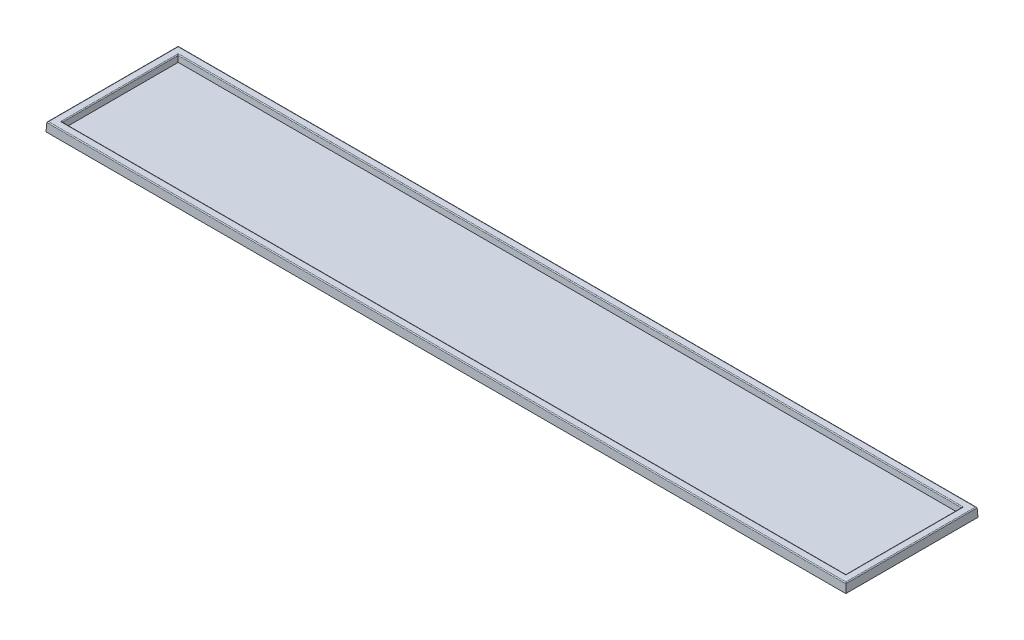
ISO-10303-21;
HEADER;
FILE_DESCRIPTION(('STEP AP214'),'2;1');
FILE_NAME('part.step','',(''),(''),'','','');
FILE_SCHEMA(('AUTOMOTIVE_DESIGN { 1 0 10303 214 1 1 1 1 }'));
ENDSEC;
DATA;
#1=APPLICATION_CONTEXT('core data for automotive mechanical design processes');
#2=APPLICATION_PROTOCOL_DEFINITION('international standard','automotive_design',2000,#1);
#3=PRODUCT_CONTEXT('',#1,'mechanical');
#4=PRODUCT('Part','Part','',(#3));
#5=PRODUCT_RELATED_PRODUCT_CATEGORY('part','',(#4));
#6=PRODUCT_DEFINITION_FORMATION('','',#4);
#7=PRODUCT_DEFINITION_CONTEXT('part definition',#1,'design');
#8=PRODUCT_DEFINITION('design','',#6,#7);
#9=PRODUCT_DEFINITION_SHAPE('','',#8);
#10=(LENGTH_UNIT() NAMED_UNIT(*) SI_UNIT(.MILLI.,.METRE.));
#11=(NAMED_UNIT(*) PLANE_ANGLE_UNIT() SI_UNIT($,.RADIAN.));
#12=(NAMED_UNIT(*) SI_UNIT($,.STERADIAN.) SOLID_ANGLE_UNIT());
#13=UNCERTAINTY_MEASURE_WITH_UNIT(LENGTH_MEASURE(1.E-05),#10,'distance_accuracy_value','');
#14=(GEOMETRIC_REPRESENTATION_CONTEXT(3) GLOBAL_UNCERTAINTY_ASSIGNED_CONTEXT((#13)) GLOBAL_UNIT_ASSIGNED_CONTEXT((#10,
#11,#12)) REPRESENTATION_CONTEXT('',''));
#15=CARTESIAN_POINT('',(0.,0.,0.));
#16=DIRECTION('',(0.,0.,1.));
#17=DIRECTION('',(1.,0.,0.));
#18=AXIS2_PLACEMENT_3D('',#15,#16,#17);
#19=CARTESIAN_POINT('',(449.25,0.,74.25));
#20=DIRECTION('',(0.998629534754574,0.0523359562429439,0.));
#21=DIRECTION('',(-0.052335956242944,0.998629534754574,0.));
#22=AXIS2_PLACEMENT_3D('',#19,#20,#21);
#23=PLANE('',#22);
#24=DIRECTION('',(0.052264427688714,-0.997264688634237,-0.052264427688714));
#25=VECTOR('',#24,1.);
#26=CARTESIAN_POINT('',(446.795683994136,46.8311391827604,-71.7956839941365));
#27=LINE('',#26,#25);
#28=CARTESIAN_POINT('',(448.775587175209,9.05233595624294,-73.7755871752093));
#29=VERTEX_POINT('',#28);
#30=CARTESIAN_POINT('',(449.25,0.,-74.25));
#31=VERTEX_POINT('',#30);
#32=EDGE_CURVE('E168',#29,#31,#27,.T.);
#33=ORIENTED_EDGE('',*,*,#32,.F.);
#34=DIRECTION('',(0.,0.,-1.));
#35=VECTOR('',#34,1.);
#36=CARTESIAN_POINT('',(448.775587175209,9.05233595624294,74.25));
#37=LINE('',#36,#35);
#38=CARTESIAN_POINT('',(448.775587175209,9.05233595624294,73.7755871752093));
#39=VERTEX_POINT('',#38);
#40=EDGE_CURVE('E200',#29,#39,#37,.F.);
#41=ORIENTED_EDGE('',*,*,#40,.T.);
#42=DIRECTION('',(0.052264427688714,-0.997264688634237,0.052264427688714));
#43=VECTOR('',#42,1.);
#44=CARTESIAN_POINT('',(449.25,0.,74.25));
#45=LINE('',#44,#43);
#46=CARTESIAN_POINT('',(449.25,0.,74.25));
#47=VERTEX_POINT('',#46);
#48=EDGE_CURVE('E167',#39,#47,#45,.T.);
#49=ORIENTED_EDGE('',*,*,#48,.T.);
#50=DIRECTION('',(0.,0.,-1.));
#51=VECTOR('',#50,1.);
#52=CARTESIAN_POINT('',(449.25,0.,74.25));
#53=LINE('',#52,#51);
#54=EDGE_CURVE('E132',#47,#31,#53,.T.);
#55=ORIENTED_EDGE('',*,*,#54,.T.);
#56=EDGE_LOOP('',(#33,#41,#49,#55));
#57=FACE_BOUND('',#56,.T.);
#58=ADVANCED_FACE('F39',(#57),#23,.T.);
#59=CARTESIAN_POINT('',(-449.25,0.,-74.25));
#60=DIRECTION('',(0.,0.0523359562429439,-0.998629534754574));
#61=DIRECTION('',(0.,0.998629534754574,0.052335956242944));
#62=AXIS2_PLACEMENT_3D('',#59,#60,#61);
#63=PLANE('',#62);
#64=DIRECTION('',(-0.052264427688714,-0.997264688634237,-0.052264427688714));
#65=VECTOR('',#64,1.);
#66=CARTESIAN_POINT('',(-448.844361795358,7.74003802853636,-73.8443617953581));
#67=LINE('',#66,#65);
#68=CARTESIAN_POINT('',(-448.775587175209,9.05233595624294,-73.7755871752093));
#69=VERTEX_POINT('',#68);
#70=CARTESIAN_POINT('',(-449.25,0.,-74.25));
#71=VERTEX_POINT('',#70);
#72=EDGE_CURVE('E171',#69,#71,#67,.T.);
#73=ORIENTED_EDGE('',*,*,#72,.F.);
#74=DIRECTION('',(-1.,0.,0.));
#75=VECTOR('',#74,1.);
#76=CARTESIAN_POINT('',(-449.25,9.05233595624294,-73.7755871752093));
#77=LINE('',#76,#75);
#78=EDGE_CURVE('E198',#69,#29,#77,.F.);
#79=ORIENTED_EDGE('',*,*,#78,.T.);
#80=ORIENTED_EDGE('',*,*,#32,.T.);
#81=DIRECTION('',(-1.,0.,0.));
#82=VECTOR('',#81,1.);
#83=CARTESIAN_POINT('',(-449.25,0.,-74.25));
#84=LINE('',#83,#82);
#85=EDGE_CURVE('E158',#31,#71,#84,.T.);
#86=ORIENTED_EDGE('',*,*,#85,.T.);
#87=EDGE_LOOP('',(#73,#79,#80,#86));
#88=FACE_BOUND('',#87,.T.);
#89=ADVANCED_FACE('F259',(#88),#63,.T.);
#90=CARTESIAN_POINT('',(-449.25,0.,74.25));
#91=DIRECTION('',(-0.998629534754574,0.0523359562429439,0.));
#92=DIRECTION('',(-0.052335956242944,-0.998629534754574,0.));
#93=AXIS2_PLACEMENT_3D('',#90,#91,#92);
#94=PLANE('',#93);
#95=DIRECTION('',(-0.052264427688714,-0.997264688634237,0.052264427688714));
#96=VECTOR('',#95,1.);
#97=CARTESIAN_POINT('',(-449.25,0.,74.25));
#98=LINE('',#97,#96);
#99=CARTESIAN_POINT('',(-448.775587175209,9.05233595624294,73.7755871752093));
#100=VERTEX_POINT('',#99);
#101=CARTESIAN_POINT('',(-449.25,0.,74.25));
#102=VERTEX_POINT('',#101);
#103=EDGE_CURVE('E173',#100,#102,#98,.T.);
#104=ORIENTED_EDGE('',*,*,#103,.F.);
#105=DIRECTION('',(0.,0.,1.));
#106=VECTOR('',#105,1.);
#107=CARTESIAN_POINT('',(-448.775587175209,9.05233595624294,74.25));
#108=LINE('',#107,#106);
#109=EDGE_CURVE('E196',#100,#69,#108,.F.);
#110=ORIENTED_EDGE('',*,*,#109,.T.);
#111=ORIENTED_EDGE('',*,*,#72,.T.);
#112=DIRECTION('',(0.,0.,1.));
#113=VECTOR('',#112,1.);
#114=CARTESIAN_POINT('',(-449.25,0.,74.25));
#115=LINE('',#114,#113);
#116=EDGE_CURVE('E161',#71,#102,#115,.T.);
#117=ORIENTED_EDGE('',*,*,#116,.T.);
#118=EDGE_LOOP('',(#104,#110,#111,#117));
#119=FACE_BOUND('',#118,.T.);
#120=ADVANCED_FACE('F265',(#119),#94,.T.);
#121=CARTESIAN_POINT('',(-449.25,0.,74.25));
#122=DIRECTION('',(0.,0.0523359562429439,0.998629534754574));
#123=DIRECTION('',(0.,-0.998629534754574,0.052335956242944));
#124=AXIS2_PLACEMENT_3D('',#121,#122,#123);
#125=PLANE('',#124);
#126=ORIENTED_EDGE('',*,*,#48,.F.);
#127=DIRECTION('',(1.,0.,0.));
#128=VECTOR('',#127,1.);
#129=CARTESIAN_POINT('',(-449.25,9.05233595624294,73.7755871752093));
#130=LINE('',#129,#128);
#131=EDGE_CURVE('E193',#39,#100,#130,.F.);
#132=ORIENTED_EDGE('',*,*,#131,.T.);
#133=ORIENTED_EDGE('',*,*,#103,.T.);
#134=DIRECTION('',(1.,0.,0.));
#135=VECTOR('',#134,1.);
#136=CARTESIAN_POINT('',(-449.25,0.,74.25));
#137=LINE('',#136,#135);
#138=EDGE_CURVE('E164',#102,#47,#137,.T.);
#139=ORIENTED_EDGE('',*,*,#138,.T.);
#140=EDGE_LOOP('',(#126,#132,#133,#139));
#141=FACE_BOUND('',#140,.T.);
#142=ADVANCED_FACE('F273',(#141),#125,.T.);
#143=CARTESIAN_POINT('',(0.,10.,0.));
#144=DIRECTION('',(0.,-1.,0.));
#145=DIRECTION('',(0.,0.,-1.));
#146=AXIS2_PLACEMENT_3D('',#143,#144,#145);
#147=PLANE('',#146);
#148=DIRECTION('',(0.,0.,-1.));
#149=VECTOR('',#148,1.);
#150=CARTESIAN_POINT('',(-447.776957640455,10.,0.));
#151=LINE('',#150,#149);
#152=CARTESIAN_POINT('',(-447.776957640455,10.,-72.7769576404547));
#153=VERTEX_POINT('',#152);
#154=CARTESIAN_POINT('',(-447.776957640455,10.,72.7769576404547));
#155=VERTEX_POINT('',#154);
#156=EDGE_CURVE('E188',#153,#155,#151,.F.);
#157=ORIENTED_EDGE('',*,*,#156,.T.);
#158=DIRECTION('',(-1.,0.,0.));
#159=VECTOR('',#158,1.);
#160=CARTESIAN_POINT('',(0.,10.,72.7769576404547));
#161=LINE('',#160,#159);
#162=CARTESIAN_POINT('',(447.776957640455,10.,72.7769576404547));
#163=VERTEX_POINT('',#162);
#164=EDGE_CURVE('E190',#155,#163,#161,.F.);
#165=ORIENTED_EDGE('',*,*,#164,.T.);
#166=DIRECTION('',(0.,0.,1.));
#167=VECTOR('',#166,1.);
#168=CARTESIAN_POINT('',(447.776957640455,10.,0.));
#169=LINE('',#168,#167);
#170=CARTESIAN_POINT('',(447.776957640455,10.,-72.7769576404547));
#171=VERTEX_POINT('',#170);
#172=EDGE_CURVE('E184',#163,#171,#169,.F.);
#173=ORIENTED_EDGE('',*,*,#172,.T.);
#174=DIRECTION('',(1.,0.,0.));
#175=VECTOR('',#174,1.);
#176=CARTESIAN_POINT('',(0.,10.,-72.7769576404547));
#177=LINE('',#176,#175);
#178=EDGE_CURVE('E186',#171,#153,#177,.F.);
#179=ORIENTED_EDGE('',*,*,#178,.T.);
#180=EDGE_LOOP('',(#157,#165,#173,#179));
#181=FACE_BOUND('',#180,.T.);
#182=DIRECTION('',(1.,0.,0.));
#183=VECTOR('',#182,1.);
#184=CARTESIAN_POINT('',(0.,10.,66.142253381187));
#185=LINE('',#184,#183);
#186=CARTESIAN_POINT('',(441.142253381187,10.,66.142253381187));
#187=VERTEX_POINT('',#186);
#188=CARTESIAN_POINT('',(-441.142253381187,10.,66.142253381187));
#189=VERTEX_POINT('',#188);
#190=EDGE_CURVE('E179',#187,#189,#185,.F.);
#191=ORIENTED_EDGE('',*,*,#190,.T.);
#192=DIRECTION('',(0.,0.,1.));
#193=VECTOR('',#192,1.);
#194=CARTESIAN_POINT('',(-441.142253381187,10.,0.));
#195=LINE('',#194,#193);
#196=CARTESIAN_POINT('',(-441.142253381187,10.,-66.142253381187));
#197=VERTEX_POINT('',#196);
#198=EDGE_CURVE('E181',#189,#197,#195,.F.);
#199=ORIENTED_EDGE('',*,*,#198,.T.);
#200=DIRECTION('',(-1.,0.,0.));
#201=VECTOR('',#200,1.);
#202=CARTESIAN_POINT('',(0.,10.,-66.142253381187));
#203=LINE('',#202,#201);
#204=CARTESIAN_POINT('',(441.142253381187,10.,-66.142253381187));
#205=VERTEX_POINT('',#204);
#206=EDGE_CURVE('E170',#197,#205,#203,.F.);
#207=ORIENTED_EDGE('',*,*,#206,.T.);
#208=DIRECTION('',(0.,0.,-1.));
#209=VECTOR('',#208,1.);
#210=CARTESIAN_POINT('',(441.142253381187,10.,0.));
#211=LINE('',#210,#209);
#212=EDGE_CURVE('E177',#205,#187,#211,.F.);
#213=ORIENTED_EDGE('',*,*,#212,.T.);
#214=EDGE_LOOP('',(#191,#199,#207,#213));
#215=FACE_BOUND('',#214,.T.);
#216=ADVANCED_FACE('F234',(#181,#215),#147,.F.);
#217=CARTESIAN_POINT('',(0.,0.,0.));
#218=DIRECTION('',(0.,-1.,0.));
#219=DIRECTION('',(0.,0.,-1.));
#220=AXIS2_PLACEMENT_3D('',#217,#218,#219);
#221=PLANE('',#220);
#222=ORIENTED_EDGE('',*,*,#54,.F.);
#223=ORIENTED_EDGE('',*,*,#138,.F.);
#224=ORIENTED_EDGE('',*,*,#116,.F.);
#225=ORIENTED_EDGE('',*,*,#85,.F.);
#226=EDGE_LOOP('',(#222,#223,#224,#225));
#227=FACE_BOUND('',#226,.T.);
#228=ADVANCED_FACE('F271',(#227),#221,.T.);
#229=CARTESIAN_POINT('',(440.22592220717,10.,65.2259222071696));
#230=DIRECTION('',(0.996194698091746,-0.0871557427476584,0.));
#231=DIRECTION('',(0.0871557427476584,0.996194698091746,0.));
#232=AXIS2_PLACEMENT_3D('',#229,#230,#231);
#233=PLANE('',#232);
#234=DIRECTION('',(0.0868265938642478,0.992432509138967,0.0868265938642478));
#235=VECTOR('',#234,1.);
#236=CARTESIAN_POINT('',(433.588321302743,-65.868125502452,58.588321302743));
#237=LINE('',#236,#235);
#238=CARTESIAN_POINT('',(439.613501562488,3.,64.6135015624881));
#239=VERTEX_POINT('',#238);
#240=CARTESIAN_POINT('',(440.146058683095,9.08715574274764,65.1460586830953));
#241=VERTEX_POINT('',#240);
#242=EDGE_CURVE('E127',#239,#241,#237,.T.);
#243=ORIENTED_EDGE('',*,*,#242,.T.);
#244=DIRECTION('',(0.,0.,-1.));
#245=VECTOR('',#244,1.);
#246=CARTESIAN_POINT('',(440.146058683095,9.08715574274767,65.2259222071696));
#247=LINE('',#246,#245);
#248=CARTESIAN_POINT('',(440.146058683095,9.08715574274765,-65.1460586830953));
#249=VERTEX_POINT('',#248);
#250=EDGE_CURVE('E48',#241,#249,#247,.T.);
#251=ORIENTED_EDGE('',*,*,#250,.T.);
#252=DIRECTION('',(0.0868265938642478,0.992432509138967,-0.0868265938642478));
#253=VECTOR('',#252,1.);
#254=CARTESIAN_POINT('',(439.242464354293,-1.24097469593788,-64.2424643542933));
#255=LINE('',#254,#253);
#256=CARTESIAN_POINT('',(439.613501562488,3.,-64.6135015624881));
#257=VERTEX_POINT('',#256);
#258=EDGE_CURVE('E138',#257,#249,#255,.T.);
#259=ORIENTED_EDGE('',*,*,#258,.F.);
#260=DIRECTION('',(0.,0.,-1.));
#261=VECTOR('',#260,1.);
#262=CARTESIAN_POINT('',(439.613501562488,3.,65.2259222071696));
#263=LINE('',#262,#261);
#264=EDGE_CURVE('E136',#239,#257,#263,.T.);
#265=ORIENTED_EDGE('',*,*,#264,.F.);
#266=EDGE_LOOP('',(#243,#251,#259,#265));
#267=FACE_BOUND('',#266,.T.);
#268=ADVANCED_FACE('F137',(#267),#233,.F.);
#269=CARTESIAN_POINT('',(-440.22592220717,10.,65.2259222071696));
#270=DIRECTION('',(0.,-0.0871557427476584,0.996194698091745));
#271=DIRECTION('',(0.,-0.996194698091746,-0.0871557427476584));
#272=AXIS2_PLACEMENT_3D('',#269,#270,#271);
#273=PLANE('',#272);
#274=DIRECTION('',(-0.0868265938642478,0.992432509138967,0.0868265938642478));
#275=VECTOR('',#274,1.);
#276=CARTESIAN_POINT('',(-440.22592220717,10.,65.2259222071696));
#277=LINE('',#276,#275);
#278=CARTESIAN_POINT('',(-439.613501562488,3.,64.6135015624881));
#279=VERTEX_POINT('',#278);
#280=CARTESIAN_POINT('',(-440.146058683095,9.08715574274766,65.1460586830953));
#281=VERTEX_POINT('',#280);
#282=EDGE_CURVE('E133',#279,#281,#277,.T.);
#283=ORIENTED_EDGE('',*,*,#282,.T.);
#284=DIRECTION('',(1.,0.,0.));
#285=VECTOR('',#284,1.);
#286=CARTESIAN_POINT('',(-440.22592220717,9.08715574274766,65.1460586830953));
#287=LINE('',#286,#285);
#288=EDGE_CURVE('E63',#281,#241,#287,.T.);
#289=ORIENTED_EDGE('',*,*,#288,.T.);
#290=ORIENTED_EDGE('',*,*,#242,.F.);
#291=DIRECTION('',(1.,0.,0.));
#292=VECTOR('',#291,1.);
#293=CARTESIAN_POINT('',(-440.22592220717,3.,64.6135015624881));
#294=LINE('',#293,#292);
#295=EDGE_CURVE('E131',#279,#239,#294,.T.);
#296=ORIENTED_EDGE('',*,*,#295,.F.);
#297=EDGE_LOOP('',(#283,#289,#290,#296));
#298=FACE_BOUND('',#297,.T.);
#299=ADVANCED_FACE('F129',(#298),#273,.F.);
#300=CARTESIAN_POINT('',(-440.22592220717,10.,65.2259222071696));
#301=DIRECTION('',(-0.996194698091746,-0.0871557427476584,0.));
#302=DIRECTION('',(0.0871557427476584,-0.996194698091746,0.));
#303=AXIS2_PLACEMENT_3D('',#300,#301,#302);
#304=PLANE('',#303);
#305=DIRECTION('',(-0.0868265938642478,0.992432509138967,-0.0868265938642478));
#306=VECTOR('',#305,1.);
#307=CARTESIAN_POINT('',(-440.22592220717,10.,-65.2259222071696));
#308=LINE('',#307,#306);
#309=CARTESIAN_POINT('',(-439.613501562488,3.,-64.6135015624881));
#310=VERTEX_POINT('',#309);
#311=CARTESIAN_POINT('',(-440.146058683095,9.08715574274766,-65.1460586830953));
#312=VERTEX_POINT('',#311);
#313=EDGE_CURVE('E150',#310,#312,#308,.T.);
#314=ORIENTED_EDGE('',*,*,#313,.T.);
#315=DIRECTION('',(0.,0.,1.));
#316=VECTOR('',#315,1.);
#317=CARTESIAN_POINT('',(-440.146058683095,9.08715574274767,65.2259222071696));
#318=LINE('',#317,#316);
#319=EDGE_CURVE('E202',#312,#281,#318,.T.);
#320=ORIENTED_EDGE('',*,*,#319,.T.);
#321=ORIENTED_EDGE('',*,*,#282,.F.);
#322=DIRECTION('',(0.,0.,1.));
#323=VECTOR('',#322,1.);
#324=CARTESIAN_POINT('',(-439.613501562488,3.,65.2259222071696));
#325=LINE('',#324,#323);
#326=EDGE_CURVE('E148',#310,#279,#325,.T.);
#327=ORIENTED_EDGE('',*,*,#326,.F.);
#328=EDGE_LOOP('',(#314,#320,#321,#327));
#329=FACE_BOUND('',#328,.T.);
#330=ADVANCED_FACE('F243',(#329),#304,.F.);
#331=CARTESIAN_POINT('',(-440.22592220717,10.,-65.2259222071696));
#332=DIRECTION('',(0.,-0.0871557427476584,-0.996194698091745));
#333=DIRECTION('',(0.,0.996194698091746,-0.0871557427476584));
#334=AXIS2_PLACEMENT_3D('',#331,#332,#333);
#335=PLANE('',#334);
#336=ORIENTED_EDGE('',*,*,#258,.T.);
#337=DIRECTION('',(-1.,0.,0.));
#338=VECTOR('',#337,1.);
#339=CARTESIAN_POINT('',(-440.22592220717,9.08715574274766,-65.1460586830953));
#340=LINE('',#339,#338);
#341=EDGE_CURVE('E11',#249,#312,#340,.T.);
#342=ORIENTED_EDGE('',*,*,#341,.T.);
#343=ORIENTED_EDGE('',*,*,#313,.F.);
#344=DIRECTION('',(-1.,0.,0.));
#345=VECTOR('',#344,1.);
#346=CARTESIAN_POINT('',(-440.22592220717,3.,-64.6135015624881));
#347=LINE('',#346,#345);
#348=EDGE_CURVE('E142',#257,#310,#347,.T.);
#349=ORIENTED_EDGE('',*,*,#348,.F.);
#350=EDGE_LOOP('',(#336,#342,#343,#349));
#351=FACE_BOUND('',#350,.T.);
#352=ADVANCED_FACE('F246',(#351),#335,.F.);
#353=CARTESIAN_POINT('',(0.,3.,0.));
#354=DIRECTION('',(0.,-1.,0.));
#355=DIRECTION('',(0.,0.,-1.));
#356=AXIS2_PLACEMENT_3D('',#353,#354,#355);
#357=PLANE('',#356);
#358=ORIENTED_EDGE('',*,*,#264,.T.);
#359=ORIENTED_EDGE('',*,*,#348,.T.);
#360=ORIENTED_EDGE('',*,*,#326,.T.);
#361=ORIENTED_EDGE('',*,*,#295,.T.);
#362=EDGE_LOOP('',(#358,#359,#360,#361));
#363=FACE_BOUND('',#362,.T.);
#364=ADVANCED_FACE('F146',(#363),#357,.F.);
#365=CARTESIAN_POINT('',(0.,9.,-72.7769576404547));
#366=DIRECTION('',(1.,0.,0.));
#367=DIRECTION('',(0.,0.,-1.));
#368=AXIS2_PLACEMENT_3D('',#365,#366,#367);
#369=CYLINDRICAL_SURFACE('',#368,1.);
#370=CARTESIAN_POINT('',(447.776957640455,9.,-72.7769576404547));
#371=DIRECTION('',(0.707106781186547,0.,0.707106781186547));
#372=DIRECTION('',(-0.707106781186547,0.,0.707106781186547));
#373=AXIS2_PLACEMENT_3D('',#370,#371,#372);
#374=ELLIPSE('',#373,1.41421356237309,1.);
#375=EDGE_CURVE('E211',#29,#171,#374,.T.);
#376=ORIENTED_EDGE('',*,*,#375,.F.);
#377=ORIENTED_EDGE('',*,*,#78,.F.);
#378=CARTESIAN_POINT('',(-447.776957640455,9.,-72.7769576404547));
#379=DIRECTION('',(0.707106781186547,0.,-0.707106781186547));
#380=DIRECTION('',(0.707106781186547,0.,0.707106781186547));
#381=AXIS2_PLACEMENT_3D('',#378,#379,#380);
#382=ELLIPSE('',#381,1.41421356237309,1.);
#383=EDGE_CURVE('E143',#153,#69,#382,.F.);
#384=ORIENTED_EDGE('',*,*,#383,.F.);
#385=ORIENTED_EDGE('',*,*,#178,.F.);
#386=EDGE_LOOP('',(#376,#377,#384,#385));
#387=FACE_BOUND('',#386,.T.);
#388=ADVANCED_FACE('F254',(#387),#369,.T.);
#389=CARTESIAN_POINT('',(-447.776957640455,9.,0.));
#390=DIRECTION('',(0.,0.,-1.));
#391=DIRECTION('',(-1.,0.,0.));
#392=AXIS2_PLACEMENT_3D('',#389,#390,#391);
#393=CYLINDRICAL_SURFACE('',#392,1.);
#394=ORIENTED_EDGE('',*,*,#383,.T.);
#395=ORIENTED_EDGE('',*,*,#109,.F.);
#396=CARTESIAN_POINT('',(-447.776957640455,9.,72.7769576404547));
#397=DIRECTION('',(-0.707106781186547,0.,-0.707106781186547));
#398=DIRECTION('',(0.707106781186547,0.,-0.707106781186547));
#399=AXIS2_PLACEMENT_3D('',#396,#397,#398);
#400=ELLIPSE('',#399,1.41421356237309,1.);
#401=EDGE_CURVE('E209',#155,#100,#400,.F.);
#402=ORIENTED_EDGE('',*,*,#401,.F.);
#403=ORIENTED_EDGE('',*,*,#156,.F.);
#404=EDGE_LOOP('',(#394,#395,#402,#403));
#405=FACE_BOUND('',#404,.T.);
#406=ADVANCED_FACE('F287',(#405),#393,.T.);
#407=CARTESIAN_POINT('',(447.776957640455,9.,0.));
#408=DIRECTION('',(0.,0.,1.));
#409=DIRECTION('',(1.,0.,0.));
#410=AXIS2_PLACEMENT_3D('',#407,#408,#409);
#411=CYLINDRICAL_SURFACE('',#410,1.);
#412=ORIENTED_EDGE('',*,*,#375,.T.);
#413=ORIENTED_EDGE('',*,*,#172,.F.);
#414=CARTESIAN_POINT('',(447.776957640455,9.,72.7769576404547));
#415=DIRECTION('',(-0.707106781186547,0.,0.707106781186547));
#416=DIRECTION('',(0.707106781186547,0.,0.707106781186547));
#417=AXIS2_PLACEMENT_3D('',#414,#415,#416);
#418=ELLIPSE('',#417,1.41421356237309,1.);
#419=EDGE_CURVE('E207',#39,#163,#418,.T.);
#420=ORIENTED_EDGE('',*,*,#419,.F.);
#421=ORIENTED_EDGE('',*,*,#40,.F.);
#422=EDGE_LOOP('',(#412,#413,#420,#421));
#423=FACE_BOUND('',#422,.T.);
#424=ADVANCED_FACE('F283',(#423),#411,.T.);
#425=CARTESIAN_POINT('',(0.,9.,72.7769576404547));
#426=DIRECTION('',(-1.,0.,0.));
#427=DIRECTION('',(0.,0.,1.));
#428=AXIS2_PLACEMENT_3D('',#425,#426,#427);
#429=CYLINDRICAL_SURFACE('',#428,1.);
#430=ORIENTED_EDGE('',*,*,#401,.T.);
#431=ORIENTED_EDGE('',*,*,#131,.F.);
#432=ORIENTED_EDGE('',*,*,#419,.T.);
#433=ORIENTED_EDGE('',*,*,#164,.F.);
#434=EDGE_LOOP('',(#430,#431,#432,#433));
#435=FACE_BOUND('',#434,.T.);
#436=ADVANCED_FACE('F280',(#435),#429,.T.);
#437=CARTESIAN_POINT('',(441.142253381187,9.,65.2259222071696));
#438=DIRECTION('',(0.,0.,-1.));
#439=DIRECTION('',(-1.,0.,0.));
#440=AXIS2_PLACEMENT_3D('',#437,#438,#439);
#441=CYLINDRICAL_SURFACE('',#440,1.);
#442=CARTESIAN_POINT('',(441.142253381187,9.,66.142253381187));
#443=DIRECTION('',(0.707106781186547,0.,-0.707106781186547));
#444=DIRECTION('',(0.707106781186547,0.,0.707106781186547));
#445=AXIS2_PLACEMENT_3D('',#442,#443,#444);
#446=ELLIPSE('',#445,1.41421356237309,1.);
#447=EDGE_CURVE('E219',#187,#241,#446,.F.);
#448=ORIENTED_EDGE('',*,*,#447,.F.);
#449=ORIENTED_EDGE('',*,*,#212,.F.);
#450=CARTESIAN_POINT('',(441.142253381187,9.,-66.142253381187));
#451=DIRECTION('',(-0.707106781186547,0.,-0.707106781186547));
#452=DIRECTION('',(0.707106781186547,0.,-0.707106781186547));
#453=AXIS2_PLACEMENT_3D('',#450,#451,#452);
#454=ELLIPSE('',#453,1.41421356237309,1.);
#455=EDGE_CURVE('E43',#249,#205,#454,.T.);
#456=ORIENTED_EDGE('',*,*,#455,.F.);
#457=ORIENTED_EDGE('',*,*,#250,.F.);
#458=EDGE_LOOP('',(#448,#449,#456,#457));
#459=FACE_BOUND('',#458,.T.);
#460=ADVANCED_FACE('F41',(#459),#441,.T.);
#461=CARTESIAN_POINT('',(-440.22592220717,9.,-66.142253381187));
#462=DIRECTION('',(-1.,0.,0.));
#463=DIRECTION('',(0.,0.,1.));
#464=AXIS2_PLACEMENT_3D('',#461,#462,#463);
#465=CYLINDRICAL_SURFACE('',#464,1.);
#466=ORIENTED_EDGE('',*,*,#455,.T.);
#467=ORIENTED_EDGE('',*,*,#206,.F.);
#468=CARTESIAN_POINT('',(-441.142253381187,9.,-66.142253381187));
#469=DIRECTION('',(-0.707106781186547,0.,0.707106781186547));
#470=DIRECTION('',(0.707106781186547,0.,0.707106781186547));
#471=AXIS2_PLACEMENT_3D('',#468,#469,#470);
#472=ELLIPSE('',#471,1.41421356237309,1.);
#473=EDGE_CURVE('E218',#312,#197,#472,.T.);
#474=ORIENTED_EDGE('',*,*,#473,.F.);
#475=ORIENTED_EDGE('',*,*,#341,.F.);
#476=EDGE_LOOP('',(#466,#467,#474,#475));
#477=FACE_BOUND('',#476,.T.);
#478=ADVANCED_FACE('F229',(#477),#465,.T.);
#479=CARTESIAN_POINT('',(-440.22592220717,9.,66.142253381187));
#480=DIRECTION('',(1.,0.,0.));
#481=DIRECTION('',(0.,0.,-1.));
#482=AXIS2_PLACEMENT_3D('',#479,#480,#481);
#483=CYLINDRICAL_SURFACE('',#482,1.);
#484=ORIENTED_EDGE('',*,*,#447,.T.);
#485=ORIENTED_EDGE('',*,*,#288,.F.);
#486=CARTESIAN_POINT('',(-441.142253381187,9.,66.142253381187));
#487=DIRECTION('',(0.707106781186547,0.,0.707106781186547));
#488=DIRECTION('',(-0.707106781186547,0.,0.707106781186547));
#489=AXIS2_PLACEMENT_3D('',#486,#487,#488);
#490=ELLIPSE('',#489,1.41421356237309,1.);
#491=EDGE_CURVE('E216',#189,#281,#490,.F.);
#492=ORIENTED_EDGE('',*,*,#491,.F.);
#493=ORIENTED_EDGE('',*,*,#190,.F.);
#494=EDGE_LOOP('',(#484,#485,#492,#493));
#495=FACE_BOUND('',#494,.T.);
#496=ADVANCED_FACE('F240',(#495),#483,.T.);
#497=CARTESIAN_POINT('',(-441.142253381187,9.,65.2259222071696));
#498=DIRECTION('',(0.,0.,1.));
#499=DIRECTION('',(1.,0.,0.));
#500=AXIS2_PLACEMENT_3D('',#497,#498,#499);
#501=CYLINDRICAL_SURFACE('',#500,1.);
#502=ORIENTED_EDGE('',*,*,#473,.T.);
#503=ORIENTED_EDGE('',*,*,#198,.F.);
#504=ORIENTED_EDGE('',*,*,#491,.T.);
#505=ORIENTED_EDGE('',*,*,#319,.F.);
#506=EDGE_LOOP('',(#502,#503,#504,#505));
#507=FACE_BOUND('',#506,.T.);
#508=ADVANCED_FACE('F238',(#507),#501,.T.);
#509=CLOSED_SHELL('',(#58,#89,#120,#142,#216,#228,#268,#299,#330,#352,#364,#388,#406,#424,#436,
#460,#478,#496,#508));
#510=MANIFOLD_SOLID_BREP('B2',#509);
#511=ADVANCED_BREP_SHAPE_REPRESENTATION('',(#18,#510),#14);
#512=SHAPE_DEFINITION_REPRESENTATION(#9,#511);
ENDSEC;
END-ISO-10303-21;
